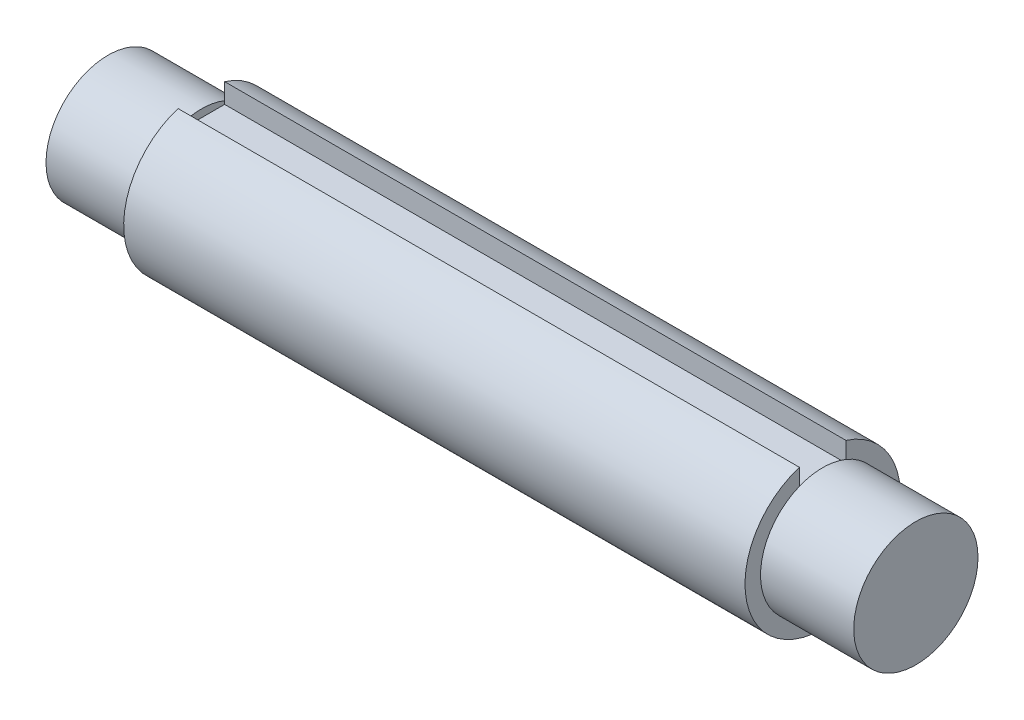
ISO-10303-21;
HEADER;
FILE_DESCRIPTION(('STEP AP214'),'2;1');
FILE_NAME('part.step','',(''),(''),'','','');
FILE_SCHEMA(('AUTOMOTIVE_DESIGN { 1 0 10303 214 1 1 1 1 }'));
ENDSEC;
DATA;
#1=APPLICATION_CONTEXT('core data for automotive mechanical design processes');
#2=APPLICATION_PROTOCOL_DEFINITION('international standard','automotive_design',2000,#1);
#3=PRODUCT_CONTEXT('',#1,'mechanical');
#4=PRODUCT('Part','Part','',(#3));
#5=PRODUCT_RELATED_PRODUCT_CATEGORY('part','',(#4));
#6=PRODUCT_DEFINITION_FORMATION('','',#4);
#7=PRODUCT_DEFINITION_CONTEXT('part definition',#1,'design');
#8=PRODUCT_DEFINITION('design','',#6,#7);
#9=PRODUCT_DEFINITION_SHAPE('','',#8);
#10=(LENGTH_UNIT() NAMED_UNIT(*) SI_UNIT(.MILLI.,.METRE.));
#11=(NAMED_UNIT(*) PLANE_ANGLE_UNIT() SI_UNIT($,.RADIAN.));
#12=(NAMED_UNIT(*) SI_UNIT($,.STERADIAN.) SOLID_ANGLE_UNIT());
#13=UNCERTAINTY_MEASURE_WITH_UNIT(LENGTH_MEASURE(1.E-05),#10,'distance_accuracy_value','');
#14=(GEOMETRIC_REPRESENTATION_CONTEXT(3) GLOBAL_UNCERTAINTY_ASSIGNED_CONTEXT((#13)) GLOBAL_UNIT_ASSIGNED_CONTEXT((#10,
#11,#12)) REPRESENTATION_CONTEXT('',''));
#15=CARTESIAN_POINT('',(0.,0.,0.));
#16=DIRECTION('',(0.,0.,1.));
#17=DIRECTION('',(1.,0.,0.));
#18=AXIS2_PLACEMENT_3D('',#15,#16,#17);
#19=CARTESIAN_POINT('',(41.275,0.,0.));
#20=DIRECTION('',(-1.,0.,0.));
#21=DIRECTION('',(0.,0.,1.));
#22=AXIS2_PLACEMENT_3D('',#19,#20,#21);
#23=CYLINDRICAL_SURFACE('',#22,7.9375);
#24=CARTESIAN_POINT('',(-31.75,0.,0.));
#25=DIRECTION('',(-1.,0.,0.));
#26=DIRECTION('',(0.,0.,1.));
#27=AXIS2_PLACEMENT_3D('',#24,#25,#26);
#28=CIRCLE('',#27,7.9375);
#29=CARTESIAN_POINT('',(-31.75,7.57189241124701,-2.38125));
#30=VERTEX_POINT('',#29);
#31=CARTESIAN_POINT('',(-31.75,7.57189241124701,2.38125));
#32=VERTEX_POINT('',#31);
#33=EDGE_CURVE('E39',#30,#32,#28,.T.);
#34=ORIENTED_EDGE('',*,*,#33,.F.);
#35=DIRECTION('',(-1.,0.,0.));
#36=VECTOR('',#35,1.);
#37=CARTESIAN_POINT('',(31.75,7.57189241124701,-2.38125));
#38=LINE('',#37,#36);
#39=CARTESIAN_POINT('',(31.75,7.57189241124701,-2.38125));
#40=VERTEX_POINT('',#39);
#41=EDGE_CURVE('E125',#40,#30,#38,.T.);
#42=ORIENTED_EDGE('',*,*,#41,.F.);
#43=CARTESIAN_POINT('',(31.75,0.,0.));
#44=DIRECTION('',(1.,0.,0.));
#45=DIRECTION('',(0.,0.,-1.));
#46=AXIS2_PLACEMENT_3D('',#43,#44,#45);
#47=CIRCLE('',#46,7.9375);
#48=CARTESIAN_POINT('',(31.75,7.57189241124701,2.38125));
#49=VERTEX_POINT('',#48);
#50=EDGE_CURVE('E12',#49,#40,#47,.T.);
#51=ORIENTED_EDGE('',*,*,#50,.F.);
#52=DIRECTION('',(-1.,0.,0.));
#53=VECTOR('',#52,1.);
#54=CARTESIAN_POINT('',(31.75,7.57189241124701,2.38125));
#55=LINE('',#54,#53);
#56=EDGE_CURVE('E107',#49,#32,#55,.T.);
#57=ORIENTED_EDGE('',*,*,#56,.T.);
#58=EDGE_LOOP('',(#34,#42,#51,#57));
#59=FACE_BOUND('',#58,.T.);
#60=ADVANCED_FACE('F36',(#59),#23,.T.);
#61=CARTESIAN_POINT('',(31.75,0.,0.));
#62=DIRECTION('',(1.,0.,0.));
#63=DIRECTION('',(0.,0.,-1.));
#64=AXIS2_PLACEMENT_3D('',#61,#62,#63);
#65=PLANE('',#64);
#66=DIRECTION('',(0.,-1.,0.));
#67=VECTOR('',#66,1.);
#68=CARTESIAN_POINT('',(31.75,5.55625,-2.38125));
#69=LINE('',#68,#67);
#70=CARTESIAN_POINT('',(31.75,5.88660754913218,-2.38125));
#71=VERTEX_POINT('',#70);
#72=EDGE_CURVE('E108',#40,#71,#69,.T.);
#73=ORIENTED_EDGE('',*,*,#72,.T.);
#74=CARTESIAN_POINT('',(31.75,0.,0.));
#75=DIRECTION('',(1.,0.,0.));
#76=DIRECTION('',(0.,0.,-1.));
#77=AXIS2_PLACEMENT_3D('',#74,#75,#76);
#78=CIRCLE('',#77,6.35);
#79=CARTESIAN_POINT('',(31.75,5.88660754913218,2.38125));
#80=VERTEX_POINT('',#79);
#81=EDGE_CURVE('E136',#80,#71,#78,.T.);
#82=ORIENTED_EDGE('',*,*,#81,.F.);
#83=DIRECTION('',(0.,1.,0.));
#84=VECTOR('',#83,1.);
#85=CARTESIAN_POINT('',(31.75,5.55625,2.38125));
#86=LINE('',#85,#84);
#87=EDGE_CURVE('E97',#80,#49,#86,.T.);
#88=ORIENTED_EDGE('',*,*,#87,.T.);
#89=ORIENTED_EDGE('',*,*,#50,.T.);
#90=EDGE_LOOP('',(#73,#82,#88,#89));
#91=FACE_BOUND('',#90,.T.);
#92=ADVANCED_FACE('F153',(#91),#65,.T.);
#93=CARTESIAN_POINT('',(31.75,0.,0.));
#94=DIRECTION('',(1.,0.,0.));
#95=DIRECTION('',(0.,0.,-1.));
#96=AXIS2_PLACEMENT_3D('',#93,#94,#95);
#97=CYLINDRICAL_SURFACE('',#96,6.35);
#98=EDGE_CURVE('E44',#71,#80,#78,.T.);
#99=ORIENTED_EDGE('',*,*,#98,.T.);
#100=ORIENTED_EDGE('',*,*,#81,.T.);
#101=EDGE_LOOP('',(#99,#100));
#102=FACE_BOUND('',#101,.T.);
#103=CARTESIAN_POINT('',(41.275,0.,0.));
#104=DIRECTION('',(1.,0.,0.));
#105=DIRECTION('',(0.,0.,-1.));
#106=AXIS2_PLACEMENT_3D('',#103,#104,#105);
#107=CIRCLE('',#106,6.35);
#108=CARTESIAN_POINT('',(41.275,0.,-6.35));
#109=VERTEX_POINT('',#108);
#110=EDGE_CURVE('E137',#109,#109,#107,.T.);
#111=ORIENTED_EDGE('',*,*,#110,.F.);
#112=EDGE_LOOP('',(#111));
#113=FACE_BOUND('',#112,.T.);
#114=ADVANCED_FACE('F155',(#102,#113),#97,.T.);
#115=CARTESIAN_POINT('',(41.275,0.,0.));
#116=DIRECTION('',(1.,0.,0.));
#117=DIRECTION('',(0.,0.,-1.));
#118=AXIS2_PLACEMENT_3D('',#115,#116,#117);
#119=PLANE('',#118);
#120=ORIENTED_EDGE('',*,*,#110,.T.);
#121=EDGE_LOOP('',(#120));
#122=FACE_BOUND('',#121,.T.);
#123=ADVANCED_FACE('F158',(#122),#119,.T.);
#124=CARTESIAN_POINT('',(-31.75,0.,0.));
#125=DIRECTION('',(-1.,0.,0.));
#126=DIRECTION('',(0.,0.,1.));
#127=AXIS2_PLACEMENT_3D('',#124,#125,#126);
#128=PLANE('',#127);
#129=DIRECTION('',(0.,-1.,0.));
#130=VECTOR('',#129,1.);
#131=CARTESIAN_POINT('',(-31.75,5.55625,-2.38125));
#132=LINE('',#131,#130);
#133=CARTESIAN_POINT('',(-31.75,5.88660754913218,-2.38125));
#134=VERTEX_POINT('',#133);
#135=EDGE_CURVE('E51',#30,#134,#132,.T.);
#136=ORIENTED_EDGE('',*,*,#135,.F.);
#137=ORIENTED_EDGE('',*,*,#33,.T.);
#138=DIRECTION('',(0.,1.,0.));
#139=VECTOR('',#138,1.);
#140=CARTESIAN_POINT('',(-31.75,5.55625,2.38125));
#141=LINE('',#140,#139);
#142=CARTESIAN_POINT('',(-31.75,5.88660754913218,2.38125));
#143=VERTEX_POINT('',#142);
#144=EDGE_CURVE('E117',#143,#32,#141,.T.);
#145=ORIENTED_EDGE('',*,*,#144,.F.);
#146=CARTESIAN_POINT('',(-31.75,0.,0.));
#147=DIRECTION('',(-1.,0.,0.));
#148=DIRECTION('',(0.,0.,1.));
#149=AXIS2_PLACEMENT_3D('',#146,#147,#148);
#150=CIRCLE('',#149,6.35);
#151=EDGE_CURVE('E132',#134,#143,#150,.T.);
#152=ORIENTED_EDGE('',*,*,#151,.F.);
#153=EDGE_LOOP('',(#136,#137,#145,#152));
#154=FACE_BOUND('',#153,.T.);
#155=ADVANCED_FACE('F146',(#154),#128,.T.);
#156=CARTESIAN_POINT('',(-31.75,0.,0.));
#157=DIRECTION('',(-1.,0.,0.));
#158=DIRECTION('',(0.,0.,1.));
#159=AXIS2_PLACEMENT_3D('',#156,#157,#158);
#160=CYLINDRICAL_SURFACE('',#159,6.35);
#161=EDGE_CURVE('E129',#143,#134,#150,.T.);
#162=ORIENTED_EDGE('',*,*,#161,.T.);
#163=ORIENTED_EDGE('',*,*,#151,.T.);
#164=EDGE_LOOP('',(#162,#163));
#165=FACE_BOUND('',#164,.T.);
#166=CARTESIAN_POINT('',(-41.275,0.,0.));
#167=DIRECTION('',(-1.,0.,0.));
#168=DIRECTION('',(0.,0.,1.));
#169=AXIS2_PLACEMENT_3D('',#166,#167,#168);
#170=CIRCLE('',#169,6.35);
#171=CARTESIAN_POINT('',(-41.275,0.,6.35));
#172=VERTEX_POINT('',#171);
#173=EDGE_CURVE('E124',#172,#172,#170,.T.);
#174=ORIENTED_EDGE('',*,*,#173,.F.);
#175=EDGE_LOOP('',(#174));
#176=FACE_BOUND('',#175,.T.);
#177=ADVANCED_FACE('F190',(#165,#176),#160,.T.);
#178=CARTESIAN_POINT('',(-41.275,0.,0.));
#179=DIRECTION('',(1.,0.,0.));
#180=DIRECTION('',(0.,0.,-1.));
#181=AXIS2_PLACEMENT_3D('',#178,#179,#180);
#182=PLANE('',#181);
#183=ORIENTED_EDGE('',*,*,#173,.T.);
#184=EDGE_LOOP('',(#183));
#185=FACE_BOUND('',#184,.T.);
#186=ADVANCED_FACE('F198',(#185),#182,.F.);
#187=CARTESIAN_POINT('',(31.75,5.55625,-2.38125));
#188=DIRECTION('',(0.,0.,-1.));
#189=DIRECTION('',(-1.,0.,0.));
#190=AXIS2_PLACEMENT_3D('',#187,#188,#189);
#191=PLANE('',#190);
#192=ORIENTED_EDGE('',*,*,#135,.T.);
#193=CARTESIAN_POINT('',(-31.75,5.55625,-2.38125));
#194=VERTEX_POINT('',#193);
#195=EDGE_CURVE('E120',#134,#194,#132,.T.);
#196=ORIENTED_EDGE('',*,*,#195,.T.);
#197=DIRECTION('',(-1.,0.,0.));
#198=VECTOR('',#197,1.);
#199=CARTESIAN_POINT('',(31.75,5.55625,-2.38125));
#200=LINE('',#199,#198);
#201=CARTESIAN_POINT('',(31.75,5.55625,-2.38125));
#202=VERTEX_POINT('',#201);
#203=EDGE_CURVE('E122',#202,#194,#200,.T.);
#204=ORIENTED_EDGE('',*,*,#203,.F.);
#205=EDGE_CURVE('E93',#71,#202,#69,.T.);
#206=ORIENTED_EDGE('',*,*,#205,.F.);
#207=ORIENTED_EDGE('',*,*,#72,.F.);
#208=ORIENTED_EDGE('',*,*,#41,.T.);
#209=EDGE_LOOP('',(#192,#196,#204,#206,#207,#208));
#210=FACE_BOUND('',#209,.T.);
#211=ADVANCED_FACE('F206',(#210),#191,.F.);
#212=CARTESIAN_POINT('',(31.75,5.55625,2.38125));
#213=DIRECTION('',(0.,0.,1.));
#214=DIRECTION('',(1.,0.,0.));
#215=AXIS2_PLACEMENT_3D('',#212,#213,#214);
#216=PLANE('',#215);
#217=CARTESIAN_POINT('',(-31.75,5.55625,2.38125));
#218=VERTEX_POINT('',#217);
#219=EDGE_CURVE('E118',#218,#143,#141,.T.);
#220=ORIENTED_EDGE('',*,*,#219,.T.);
#221=ORIENTED_EDGE('',*,*,#144,.T.);
#222=ORIENTED_EDGE('',*,*,#56,.F.);
#223=ORIENTED_EDGE('',*,*,#87,.F.);
#224=CARTESIAN_POINT('',(31.75,5.55625,2.38125));
#225=VERTEX_POINT('',#224);
#226=EDGE_CURVE('E91',#225,#80,#86,.T.);
#227=ORIENTED_EDGE('',*,*,#226,.F.);
#228=DIRECTION('',(-1.,0.,0.));
#229=VECTOR('',#228,1.);
#230=CARTESIAN_POINT('',(31.75,5.55625,2.38125));
#231=LINE('',#230,#229);
#232=EDGE_CURVE('E100',#225,#218,#231,.T.);
#233=ORIENTED_EDGE('',*,*,#232,.T.);
#234=EDGE_LOOP('',(#220,#221,#222,#223,#227,#233));
#235=FACE_BOUND('',#234,.T.);
#236=ADVANCED_FACE('F110',(#235),#216,.F.);
#237=CARTESIAN_POINT('',(31.75,5.55625,0.));
#238=DIRECTION('',(0.,-1.,0.));
#239=DIRECTION('',(0.,0.,-1.));
#240=AXIS2_PLACEMENT_3D('',#237,#238,#239);
#241=PLANE('',#240);
#242=DIRECTION('',(0.,0.,1.));
#243=VECTOR('',#242,1.);
#244=CARTESIAN_POINT('',(-31.75,5.55625,0.));
#245=LINE('',#244,#243);
#246=EDGE_CURVE('E103',#194,#218,#245,.T.);
#247=ORIENTED_EDGE('',*,*,#246,.T.);
#248=ORIENTED_EDGE('',*,*,#232,.F.);
#249=DIRECTION('',(0.,0.,1.));
#250=VECTOR('',#249,1.);
#251=CARTESIAN_POINT('',(31.75,5.55625,0.));
#252=LINE('',#251,#250);
#253=EDGE_CURVE('E87',#202,#225,#252,.T.);
#254=ORIENTED_EDGE('',*,*,#253,.F.);
#255=ORIENTED_EDGE('',*,*,#203,.T.);
#256=EDGE_LOOP('',(#247,#248,#254,#255));
#257=FACE_BOUND('',#256,.T.);
#258=ADVANCED_FACE('F101',(#257),#241,.F.);
#259=CARTESIAN_POINT('',(31.75,0.,0.));
#260=DIRECTION('',(-1.,0.,0.));
#261=DIRECTION('',(0.,0.,1.));
#262=AXIS2_PLACEMENT_3D('',#259,#260,#261);
#263=PLANE('',#262);
#264=ORIENTED_EDGE('',*,*,#205,.T.);
#265=ORIENTED_EDGE('',*,*,#253,.T.);
#266=ORIENTED_EDGE('',*,*,#226,.T.);
#267=ORIENTED_EDGE('',*,*,#98,.F.);
#268=EDGE_LOOP('',(#264,#265,#266,#267));
#269=FACE_BOUND('',#268,.T.);
#270=ADVANCED_FACE('F89',(#269),#263,.T.);
#271=CARTESIAN_POINT('',(-31.75,0.,0.));
#272=DIRECTION('',(-1.,0.,0.));
#273=DIRECTION('',(0.,0.,1.));
#274=AXIS2_PLACEMENT_3D('',#271,#272,#273);
#275=PLANE('',#274);
#276=ORIENTED_EDGE('',*,*,#161,.F.);
#277=ORIENTED_EDGE('',*,*,#219,.F.);
#278=ORIENTED_EDGE('',*,*,#246,.F.);
#279=ORIENTED_EDGE('',*,*,#195,.F.);
#280=EDGE_LOOP('',(#276,#277,#278,#279));
#281=FACE_BOUND('',#280,.T.);
#282=ADVANCED_FACE('F235',(#281),#275,.F.);
#283=CLOSED_SHELL('',(#60,#92,#114,#123,#155,#177,#186,#211,#236,#258,#270,#282));
#284=MANIFOLD_SOLID_BREP('B2',#283);
#285=ADVANCED_BREP_SHAPE_REPRESENTATION('',(#18,#284),#14);
#286=SHAPE_DEFINITION_REPRESENTATION(#9,#285);
ENDSEC;
END-ISO-10303-21;
